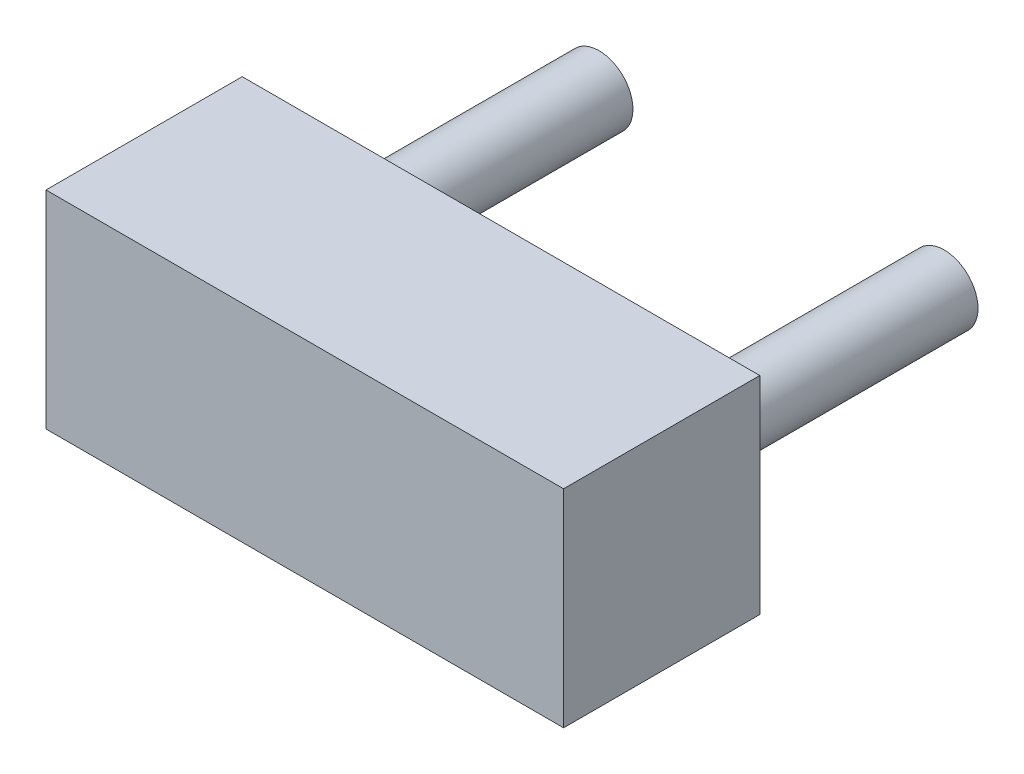
ISO-10303-21;
HEADER;
FILE_DESCRIPTION(('STEP AP214'),'2;1');
FILE_NAME('part.step','',(''),(''),'','','');
FILE_SCHEMA(('AUTOMOTIVE_DESIGN { 1 0 10303 214 1 1 1 1 }'));
ENDSEC;
DATA;
#1=APPLICATION_CONTEXT('core data for automotive mechanical design processes');
#2=APPLICATION_PROTOCOL_DEFINITION('international standard','automotive_design',2000,#1);
#3=PRODUCT_CONTEXT('',#1,'mechanical');
#4=PRODUCT('Part','Part','',(#3));
#5=PRODUCT_RELATED_PRODUCT_CATEGORY('part','',(#4));
#6=PRODUCT_DEFINITION_FORMATION('','',#4);
#7=PRODUCT_DEFINITION_CONTEXT('part definition',#1,'design');
#8=PRODUCT_DEFINITION('design','',#6,#7);
#9=PRODUCT_DEFINITION_SHAPE('','',#8);
#10=(LENGTH_UNIT() NAMED_UNIT(*) SI_UNIT(.MILLI.,.METRE.));
#11=(NAMED_UNIT(*) PLANE_ANGLE_UNIT() SI_UNIT($,.RADIAN.));
#12=(NAMED_UNIT(*) SI_UNIT($,.STERADIAN.) SOLID_ANGLE_UNIT());
#13=UNCERTAINTY_MEASURE_WITH_UNIT(LENGTH_MEASURE(1.E-05),#10,'distance_accuracy_value','');
#14=(GEOMETRIC_REPRESENTATION_CONTEXT(3) GLOBAL_UNCERTAINTY_ASSIGNED_CONTEXT((#13)) GLOBAL_UNIT_ASSIGNED_CONTEXT((#10,
#11,#12)) REPRESENTATION_CONTEXT('',''));
#15=CARTESIAN_POINT('',(0.,0.,0.));
#16=DIRECTION('',(0.,0.,1.));
#17=DIRECTION('',(1.,0.,0.));
#18=AXIS2_PLACEMENT_3D('',#15,#16,#17);
#19=CARTESIAN_POINT('',(1.275,0.,-2.));
#20=DIRECTION('',(0.,0.,1.));
#21=DIRECTION('',(1.,0.,0.));
#22=AXIS2_PLACEMENT_3D('',#19,#20,#21);
#23=CYLINDRICAL_SURFACE('',#22,0.25);
#24=CARTESIAN_POINT('',(1.275,0.,-2.));
#25=DIRECTION('',(0.,0.,1.));
#26=DIRECTION('',(1.,0.,0.));
#27=AXIS2_PLACEMENT_3D('',#24,#25,#26);
#28=CIRCLE('',#27,0.25);
#29=CARTESIAN_POINT('',(1.525,0.,-2.));
#30=VERTEX_POINT('',#29);
#31=EDGE_CURVE('E11',#30,#30,#28,.T.);
#32=ORIENTED_EDGE('',*,*,#31,.T.);
#33=EDGE_LOOP('',(#32));
#34=FACE_BOUND('',#33,.T.);
#35=CARTESIAN_POINT('',(1.275,0.,0.));
#36=DIRECTION('',(0.,0.,1.));
#37=DIRECTION('',(1.,0.,0.));
#38=AXIS2_PLACEMENT_3D('',#35,#36,#37);
#39=CIRCLE('',#38,0.25);
#40=CARTESIAN_POINT('',(1.525,0.,0.));
#41=VERTEX_POINT('',#40);
#42=EDGE_CURVE('E43',#41,#41,#39,.T.);
#43=ORIENTED_EDGE('',*,*,#42,.F.);
#44=EDGE_LOOP('',(#43));
#45=FACE_BOUND('',#44,.T.);
#46=ADVANCED_FACE('F40',(#34,#45),#23,.T.);
#47=CARTESIAN_POINT('',(1.275,0.,-2.));
#48=DIRECTION('',(0.,0.,1.));
#49=DIRECTION('',(1.,0.,0.));
#50=AXIS2_PLACEMENT_3D('',#47,#48,#49);
#51=PLANE('',#50);
#52=ORIENTED_EDGE('',*,*,#31,.F.);
#53=EDGE_LOOP('',(#52));
#54=FACE_BOUND('',#53,.T.);
#55=ADVANCED_FACE('F55',(#54),#51,.F.);
#56=CARTESIAN_POINT('',(1.275,0.,0.));
#57=DIRECTION('',(0.,0.,1.));
#58=DIRECTION('',(1.,0.,0.));
#59=AXIS2_PLACEMENT_3D('',#56,#57,#58);
#60=PLANE('',#59);
#61=ORIENTED_EDGE('',*,*,#42,.T.);
#62=EDGE_LOOP('',(#61));
#63=FACE_BOUND('',#62,.T.);
#64=ADVANCED_FACE('F52',(#63),#60,.T.);
#65=CLOSED_SHELL('',(#46,#55,#64));
#66=MANIFOLD_SOLID_BREP('B2',#65);
#67=CARTESIAN_POINT('',(-1.275,0.,-2.));
#68=DIRECTION('',(0.,0.,1.));
#69=DIRECTION('',(1.,0.,0.));
#70=AXIS2_PLACEMENT_3D('',#67,#68,#69);
#71=CYLINDRICAL_SURFACE('',#70,0.25);
#72=CARTESIAN_POINT('',(-1.275,0.,-2.));
#73=DIRECTION('',(0.,0.,1.));
#74=DIRECTION('',(1.,0.,0.));
#75=AXIS2_PLACEMENT_3D('',#72,#73,#74);
#76=CIRCLE('',#75,0.25);
#77=CARTESIAN_POINT('',(-1.025,0.,-2.));
#78=VERTEX_POINT('',#77);
#79=EDGE_CURVE('E39',#78,#78,#76,.T.);
#80=ORIENTED_EDGE('',*,*,#79,.T.);
#81=EDGE_LOOP('',(#80));
#82=FACE_BOUND('',#81,.T.);
#83=CARTESIAN_POINT('',(-1.275,0.,0.));
#84=DIRECTION('',(0.,0.,1.));
#85=DIRECTION('',(1.,0.,0.));
#86=AXIS2_PLACEMENT_3D('',#83,#84,#85);
#87=CIRCLE('',#86,0.25);
#88=CARTESIAN_POINT('',(-1.025,0.,0.));
#89=VERTEX_POINT('',#88);
#90=EDGE_CURVE('E93',#89,#89,#87,.T.);
#91=ORIENTED_EDGE('',*,*,#90,.F.);
#92=EDGE_LOOP('',(#91));
#93=FACE_BOUND('',#92,.T.);
#94=ADVANCED_FACE('F90',(#82,#93),#71,.T.);
#95=CARTESIAN_POINT('',(-1.275,0.,-2.));
#96=DIRECTION('',(0.,0.,1.));
#97=DIRECTION('',(1.,0.,0.));
#98=AXIS2_PLACEMENT_3D('',#95,#96,#97);
#99=PLANE('',#98);
#100=ORIENTED_EDGE('',*,*,#79,.F.);
#101=EDGE_LOOP('',(#100));
#102=FACE_BOUND('',#101,.T.);
#103=ADVANCED_FACE('F105',(#102),#99,.F.);
#104=CARTESIAN_POINT('',(-1.275,0.,0.));
#105=DIRECTION('',(0.,0.,1.));
#106=DIRECTION('',(1.,0.,0.));
#107=AXIS2_PLACEMENT_3D('',#104,#105,#106);
#108=PLANE('',#107);
#109=ORIENTED_EDGE('',*,*,#90,.T.);
#110=EDGE_LOOP('',(#109));
#111=FACE_BOUND('',#110,.T.);
#112=ADVANCED_FACE('F102',(#111),#108,.T.);
#113=CLOSED_SHELL('',(#94,#103,#112));
#114=MANIFOLD_SOLID_BREP('B6',#113);
#115=CARTESIAN_POINT('',(1.9125,0.765,1.45));
#116=DIRECTION('',(0.,-1.,0.));
#117=DIRECTION('',(0.,0.,-1.));
#118=AXIS2_PLACEMENT_3D('',#115,#116,#117);
#119=PLANE('',#118);
#120=DIRECTION('',(-1.,0.,0.));
#121=VECTOR('',#120,1.);
#122=CARTESIAN_POINT('',(1.9125,0.765,0.));
#123=LINE('',#122,#121);
#124=CARTESIAN_POINT('',(1.9125,0.765,0.));
#125=VERTEX_POINT('',#124);
#126=CARTESIAN_POINT('',(-1.9125,0.765,0.));
#127=VERTEX_POINT('',#126);
#128=EDGE_CURVE('E194',#125,#127,#123,.T.);
#129=ORIENTED_EDGE('',*,*,#128,.T.);
#130=DIRECTION('',(0.,0.,-1.));
#131=VECTOR('',#130,1.);
#132=CARTESIAN_POINT('',(-1.9125,0.765,1.45));
#133=LINE('',#132,#131);
#134=CARTESIAN_POINT('',(-1.9125,0.765,1.45));
#135=VERTEX_POINT('',#134);
#136=EDGE_CURVE('E88',#135,#127,#133,.T.);
#137=ORIENTED_EDGE('',*,*,#136,.F.);
#138=DIRECTION('',(-1.,0.,0.));
#139=VECTOR('',#138,1.);
#140=CARTESIAN_POINT('',(1.9125,0.765,1.45));
#141=LINE('',#140,#139);
#142=CARTESIAN_POINT('',(1.9125,0.765,1.45));
#143=VERTEX_POINT('',#142);
#144=EDGE_CURVE('E182',#143,#135,#141,.T.);
#145=ORIENTED_EDGE('',*,*,#144,.F.);
#146=DIRECTION('',(0.,0.,-1.));
#147=VECTOR('',#146,1.);
#148=CARTESIAN_POINT('',(1.9125,0.765,1.45));
#149=LINE('',#148,#147);
#150=EDGE_CURVE('E190',#143,#125,#149,.T.);
#151=ORIENTED_EDGE('',*,*,#150,.T.);
#152=EDGE_LOOP('',(#129,#137,#145,#151));
#153=FACE_BOUND('',#152,.T.);
#154=ADVANCED_FACE('F131',(#153),#119,.F.);
#155=CARTESIAN_POINT('',(-1.9125,0.765,1.45));
#156=DIRECTION('',(1.,0.,0.));
#157=DIRECTION('',(0.,0.,-1.));
#158=AXIS2_PLACEMENT_3D('',#155,#156,#157);
#159=PLANE('',#158);
#160=DIRECTION('',(0.,-1.,0.));
#161=VECTOR('',#160,1.);
#162=CARTESIAN_POINT('',(-1.9125,0.765,0.));
#163=LINE('',#162,#161);
#164=CARTESIAN_POINT('',(-1.9125,-0.765,0.));
#165=VERTEX_POINT('',#164);
#166=EDGE_CURVE('E186',#127,#165,#163,.T.);
#167=ORIENTED_EDGE('',*,*,#166,.T.);
#168=DIRECTION('',(0.,0.,-1.));
#169=VECTOR('',#168,1.);
#170=CARTESIAN_POINT('',(-1.9125,-0.765,1.45));
#171=LINE('',#170,#169);
#172=CARTESIAN_POINT('',(-1.9125,-0.765,1.45));
#173=VERTEX_POINT('',#172);
#174=EDGE_CURVE('E139',#173,#165,#171,.T.);
#175=ORIENTED_EDGE('',*,*,#174,.F.);
#176=DIRECTION('',(0.,-1.,0.));
#177=VECTOR('',#176,1.);
#178=CARTESIAN_POINT('',(-1.9125,0.765,1.45));
#179=LINE('',#178,#177);
#180=EDGE_CURVE('E177',#135,#173,#179,.T.);
#181=ORIENTED_EDGE('',*,*,#180,.F.);
#182=ORIENTED_EDGE('',*,*,#136,.T.);
#183=EDGE_LOOP('',(#167,#175,#181,#182));
#184=FACE_BOUND('',#183,.T.);
#185=ADVANCED_FACE('F185',(#184),#159,.F.);
#186=CARTESIAN_POINT('',(-1.9125,-0.765,1.45));
#187=DIRECTION('',(0.,1.,0.));
#188=DIRECTION('',(0.,0.,1.));
#189=AXIS2_PLACEMENT_3D('',#186,#187,#188);
#190=PLANE('',#189);
#191=DIRECTION('',(1.,0.,0.));
#192=VECTOR('',#191,1.);
#193=CARTESIAN_POINT('',(-1.9125,-0.765,0.));
#194=LINE('',#193,#192);
#195=CARTESIAN_POINT('',(1.9125,-0.765,0.));
#196=VERTEX_POINT('',#195);
#197=EDGE_CURVE('E164',#165,#196,#194,.T.);
#198=ORIENTED_EDGE('',*,*,#197,.T.);
#199=DIRECTION('',(0.,0.,-1.));
#200=VECTOR('',#199,1.);
#201=CARTESIAN_POINT('',(1.9125,-0.765,1.45));
#202=LINE('',#201,#200);
#203=CARTESIAN_POINT('',(1.9125,-0.765,1.45));
#204=VERTEX_POINT('',#203);
#205=EDGE_CURVE('E187',#204,#196,#202,.T.);
#206=ORIENTED_EDGE('',*,*,#205,.F.);
#207=DIRECTION('',(1.,0.,0.));
#208=VECTOR('',#207,1.);
#209=CARTESIAN_POINT('',(-1.9125,-0.765,1.45));
#210=LINE('',#209,#208);
#211=EDGE_CURVE('E180',#173,#204,#210,.T.);
#212=ORIENTED_EDGE('',*,*,#211,.F.);
#213=ORIENTED_EDGE('',*,*,#174,.T.);
#214=EDGE_LOOP('',(#198,#206,#212,#213));
#215=FACE_BOUND('',#214,.T.);
#216=ADVANCED_FACE('F188',(#215),#190,.F.);
#217=CARTESIAN_POINT('',(1.9125,-0.765,1.45));
#218=DIRECTION('',(-1.,0.,0.));
#219=DIRECTION('',(0.,0.,1.));
#220=AXIS2_PLACEMENT_3D('',#217,#218,#219);
#221=PLANE('',#220);
#222=DIRECTION('',(0.,1.,0.));
#223=VECTOR('',#222,1.);
#224=CARTESIAN_POINT('',(1.9125,-0.765,0.));
#225=LINE('',#224,#223);
#226=EDGE_CURVE('E170',#196,#125,#225,.T.);
#227=ORIENTED_EDGE('',*,*,#226,.T.);
#228=ORIENTED_EDGE('',*,*,#150,.F.);
#229=DIRECTION('',(0.,1.,0.));
#230=VECTOR('',#229,1.);
#231=CARTESIAN_POINT('',(1.9125,-0.765,1.45));
#232=LINE('',#231,#230);
#233=EDGE_CURVE('E147',#204,#143,#232,.T.);
#234=ORIENTED_EDGE('',*,*,#233,.F.);
#235=ORIENTED_EDGE('',*,*,#205,.T.);
#236=EDGE_LOOP('',(#227,#228,#234,#235));
#237=FACE_BOUND('',#236,.T.);
#238=ADVANCED_FACE('F201',(#237),#221,.F.);
#239=CARTESIAN_POINT('',(0.,0.,1.45));
#240=DIRECTION('',(0.,0.,1.));
#241=DIRECTION('',(1.,0.,0.));
#242=AXIS2_PLACEMENT_3D('',#239,#240,#241);
#243=PLANE('',#242);
#244=ORIENTED_EDGE('',*,*,#144,.T.);
#245=ORIENTED_EDGE('',*,*,#180,.T.);
#246=ORIENTED_EDGE('',*,*,#211,.T.);
#247=ORIENTED_EDGE('',*,*,#233,.T.);
#248=EDGE_LOOP('',(#244,#245,#246,#247));
#249=FACE_BOUND('',#248,.T.);
#250=ADVANCED_FACE('F178',(#249),#243,.T.);
#251=CARTESIAN_POINT('',(0.,0.,0.));
#252=DIRECTION('',(0.,0.,1.));
#253=DIRECTION('',(1.,0.,0.));
#254=AXIS2_PLACEMENT_3D('',#251,#252,#253);
#255=PLANE('',#254);
#256=ORIENTED_EDGE('',*,*,#128,.F.);
#257=ORIENTED_EDGE('',*,*,#226,.F.);
#258=ORIENTED_EDGE('',*,*,#197,.F.);
#259=ORIENTED_EDGE('',*,*,#166,.F.);
#260=EDGE_LOOP('',(#256,#257,#258,#259));
#261=FACE_BOUND('',#260,.T.);
#262=ADVANCED_FACE('F204',(#261),#255,.F.);
#263=CLOSED_SHELL('',(#154,#185,#216,#238,#250,#262));
#264=MANIFOLD_SOLID_BREP('B34',#263);
#265=ADVANCED_BREP_SHAPE_REPRESENTATION('',(#18,#66,#114,#264),#14);
#266=SHAPE_DEFINITION_REPRESENTATION(#9,#265);
ENDSEC;
END-ISO-10303-21;
